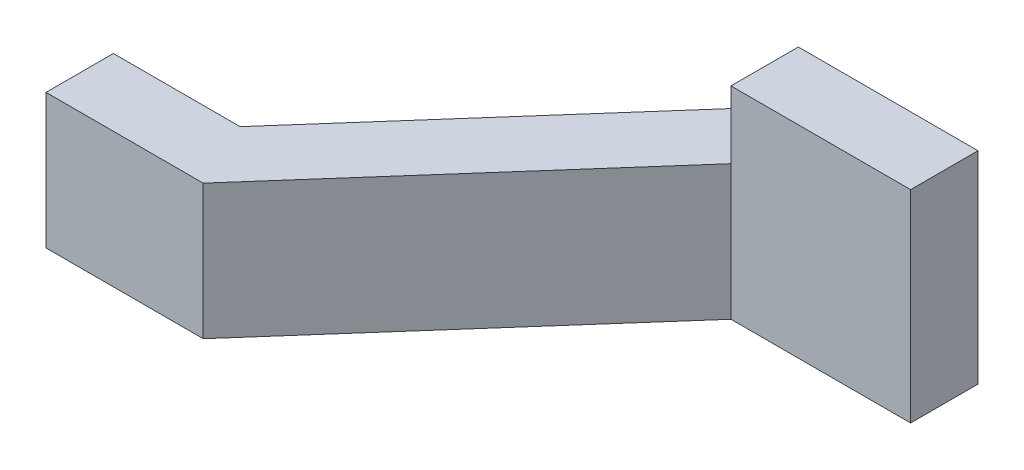
ISO-10303-21;
HEADER;
FILE_DESCRIPTION(('STEP AP214'),'2;1');
FILE_NAME('part.step','',(''),(''),'','','');
FILE_SCHEMA(('AUTOMOTIVE_DESIGN { 1 0 10303 214 1 1 1 1 }'));
ENDSEC;
DATA;
#1=APPLICATION_CONTEXT('core data for automotive mechanical design processes');
#2=APPLICATION_PROTOCOL_DEFINITION('international standard','automotive_design',2000,#1);
#3=PRODUCT_CONTEXT('',#1,'mechanical');
#4=PRODUCT('Part','Part','',(#3));
#5=PRODUCT_RELATED_PRODUCT_CATEGORY('part','',(#4));
#6=PRODUCT_DEFINITION_FORMATION('','',#4);
#7=PRODUCT_DEFINITION_CONTEXT('part definition',#1,'design');
#8=PRODUCT_DEFINITION('design','',#6,#7);
#9=PRODUCT_DEFINITION_SHAPE('','',#8);
#10=(LENGTH_UNIT() NAMED_UNIT(*) SI_UNIT(.MILLI.,.METRE.));
#11=(NAMED_UNIT(*) PLANE_ANGLE_UNIT() SI_UNIT($,.RADIAN.));
#12=(NAMED_UNIT(*) SI_UNIT($,.STERADIAN.) SOLID_ANGLE_UNIT());
#13=UNCERTAINTY_MEASURE_WITH_UNIT(LENGTH_MEASURE(1.E-05),#10,'distance_accuracy_value','');
#14=(GEOMETRIC_REPRESENTATION_CONTEXT(3) GLOBAL_UNCERTAINTY_ASSIGNED_CONTEXT((#13)) GLOBAL_UNIT_ASSIGNED_CONTEXT((#10,
#11,#12)) REPRESENTATION_CONTEXT('',''));
#15=CARTESIAN_POINT('',(0.,0.,0.));
#16=DIRECTION('',(0.,0.,1.));
#17=DIRECTION('',(1.,0.,0.));
#18=AXIS2_PLACEMENT_3D('',#15,#16,#17);
#19=CARTESIAN_POINT('',(0.,0.762,0.));
#20=DIRECTION('',(1.,0.,0.));
#21=DIRECTION('',(0.,0.,-1.));
#22=AXIS2_PLACEMENT_3D('',#19,#20,#21);
#23=PLANE('',#22);
#24=DIRECTION('',(0.,0.,-1.));
#25=VECTOR('',#24,1.);
#26=CARTESIAN_POINT('',(0.,-0.381,0.));
#27=LINE('',#26,#25);
#28=CARTESIAN_POINT('',(0.,-0.381,0.));
#29=VERTEX_POINT('',#28);
#30=CARTESIAN_POINT('',(0.,-0.381,-0.381));
#31=VERTEX_POINT('',#30);
#32=EDGE_CURVE('E191',#29,#31,#27,.T.);
#33=ORIENTED_EDGE('',*,*,#32,.F.);
#34=DIRECTION('',(0.,-1.,0.));
#35=VECTOR('',#34,1.);
#36=CARTESIAN_POINT('',(0.,0.762,0.));
#37=LINE('',#36,#35);
#38=CARTESIAN_POINT('',(0.,0.381,0.));
#39=VERTEX_POINT('',#38);
#40=EDGE_CURVE('E148',#39,#29,#37,.T.);
#41=ORIENTED_EDGE('',*,*,#40,.F.);
#42=DIRECTION('',(0.,0.,-1.));
#43=VECTOR('',#42,1.);
#44=CARTESIAN_POINT('',(0.,0.381,0.));
#45=LINE('',#44,#43);
#46=CARTESIAN_POINT('',(0.,0.381,-0.381));
#47=VERTEX_POINT('',#46);
#48=EDGE_CURVE('E176',#39,#47,#45,.T.);
#49=ORIENTED_EDGE('',*,*,#48,.T.);
#50=DIRECTION('',(0.,-1.,0.));
#51=VECTOR('',#50,1.);
#52=CARTESIAN_POINT('',(0.,0.762,-0.381));
#53=LINE('',#52,#51);
#54=EDGE_CURVE('E160',#47,#31,#53,.T.);
#55=ORIENTED_EDGE('',*,*,#54,.T.);
#56=EDGE_LOOP('',(#33,#41,#49,#55));
#57=FACE_BOUND('',#56,.T.);
#58=ADVANCED_FACE('F38',(#57),#23,.F.);
#59=CARTESIAN_POINT('',(0.,0.762,0.));
#60=DIRECTION('',(0.,0.,-1.));
#61=DIRECTION('',(-1.,0.,0.));
#62=AXIS2_PLACEMENT_3D('',#59,#60,#61);
#63=PLANE('',#62);
#64=DIRECTION('',(-1.,0.,0.));
#65=VECTOR('',#64,1.);
#66=CARTESIAN_POINT('',(0.,-0.381,0.));
#67=LINE('',#66,#65);
#68=CARTESIAN_POINT('',(0.888999999999999,-0.381,0.));
#69=VERTEX_POINT('',#68);
#70=EDGE_CURVE('E121',#69,#29,#67,.T.);
#71=ORIENTED_EDGE('',*,*,#70,.F.);
#72=DIRECTION('',(0.,-1.,0.));
#73=VECTOR('',#72,1.);
#74=CARTESIAN_POINT('',(0.889,0.762,0.));
#75=LINE('',#74,#73);
#76=CARTESIAN_POINT('',(0.889,0.381,0.));
#77=VERTEX_POINT('',#76);
#78=EDGE_CURVE('E145',#77,#69,#75,.T.);
#79=ORIENTED_EDGE('',*,*,#78,.F.);
#80=DIRECTION('',(-1.,0.,0.));
#81=VECTOR('',#80,1.);
#82=CARTESIAN_POINT('',(0.,0.381,0.));
#83=LINE('',#82,#81);
#84=EDGE_CURVE('E179',#77,#39,#83,.T.);
#85=ORIENTED_EDGE('',*,*,#84,.T.);
#86=ORIENTED_EDGE('',*,*,#40,.T.);
#87=EDGE_LOOP('',(#71,#79,#85,#86));
#88=FACE_BOUND('',#87,.T.);
#89=ADVANCED_FACE('F204',(#88),#63,.F.);
#90=CARTESIAN_POINT('',(0.889,0.762,0.));
#91=DIRECTION('',(-0.750713516922755,0.,-0.660627894892025));
#92=DIRECTION('',(-0.660627894892025,0.,0.750713516922755));
#93=AXIS2_PLACEMENT_3D('',#90,#91,#92);
#94=PLANE('',#93);
#95=DIRECTION('',(-0.660627894892025,0.,0.750713516922755));
#96=VECTOR('',#95,1.);
#97=CARTESIAN_POINT('',(0.889,-0.381,0.));
#98=LINE('',#97,#96);
#99=CARTESIAN_POINT('',(2.286,-0.381,-1.5875));
#100=VERTEX_POINT('',#99);
#101=EDGE_CURVE('E186',#100,#69,#98,.T.);
#102=ORIENTED_EDGE('',*,*,#101,.F.);
#103=DIRECTION('',(0.,-1.,0.));
#104=VECTOR('',#103,1.);
#105=CARTESIAN_POINT('',(2.286,0.762,-1.5875));
#106=LINE('',#105,#104);
#107=CARTESIAN_POINT('',(2.286,0.381,-1.5875));
#108=VERTEX_POINT('',#107);
#109=EDGE_CURVE('E136',#108,#100,#106,.T.);
#110=ORIENTED_EDGE('',*,*,#109,.F.);
#111=DIRECTION('',(-0.660627894892025,0.,0.750713516922755));
#112=VECTOR('',#111,1.);
#113=CARTESIAN_POINT('',(0.889,0.381,0.));
#114=LINE('',#113,#112);
#115=EDGE_CURVE('E172',#108,#77,#114,.T.);
#116=ORIENTED_EDGE('',*,*,#115,.T.);
#117=ORIENTED_EDGE('',*,*,#78,.T.);
#118=EDGE_LOOP('',(#102,#110,#116,#117));
#119=FACE_BOUND('',#118,.T.);
#120=ADVANCED_FACE('F201',(#119),#94,.F.);
#121=CARTESIAN_POINT('',(3.302,0.762,-1.9685));
#122=DIRECTION('',(0.,0.,1.));
#123=DIRECTION('',(1.,0.,0.));
#124=AXIS2_PLACEMENT_3D('',#121,#122,#123);
#125=PLANE('',#124);
#126=DIRECTION('',(0.,-1.,0.));
#127=VECTOR('',#126,1.);
#128=CARTESIAN_POINT('',(3.302,0.762,-1.9685));
#129=LINE('',#128,#127);
#130=CARTESIAN_POINT('',(3.302,0.762,-1.9685));
#131=VERTEX_POINT('',#130);
#132=CARTESIAN_POINT('',(3.302,-0.381,-1.9685));
#133=VERTEX_POINT('',#132);
#134=EDGE_CURVE('E127',#131,#133,#129,.T.);
#135=ORIENTED_EDGE('',*,*,#134,.T.);
#136=DIRECTION('',(-1.,0.,0.));
#137=VECTOR('',#136,1.);
#138=CARTESIAN_POINT('',(0.,-0.381,-1.9685));
#139=LINE('',#138,#137);
#140=CARTESIAN_POINT('',(2.11376282945303,-0.381,-1.9685));
#141=VERTEX_POINT('',#140);
#142=EDGE_CURVE('E110',#133,#141,#139,.T.);
#143=ORIENTED_EDGE('',*,*,#142,.T.);
#144=DIRECTION('',(0.,-1.,0.));
#145=VECTOR('',#144,1.);
#146=CARTESIAN_POINT('',(2.11376282945303,0.762,-1.9685));
#147=LINE('',#146,#145);
#148=CARTESIAN_POINT('',(2.11376282945303,0.381,-1.9685));
#149=VERTEX_POINT('',#148);
#150=EDGE_CURVE('E134',#149,#141,#147,.T.);
#151=ORIENTED_EDGE('',*,*,#150,.F.);
#152=DIRECTION('',(-1.,0.,0.));
#153=VECTOR('',#152,1.);
#154=CARTESIAN_POINT('',(0.,0.381,-1.9685));
#155=LINE('',#154,#153);
#156=CARTESIAN_POINT('',(2.286,0.381,-1.9685));
#157=VERTEX_POINT('',#156);
#158=EDGE_CURVE('E181',#157,#149,#155,.T.);
#159=ORIENTED_EDGE('',*,*,#158,.F.);
#160=DIRECTION('',(0.,-1.,0.));
#161=VECTOR('',#160,1.);
#162=CARTESIAN_POINT('',(2.286,0.762,-1.9685));
#163=LINE('',#162,#161);
#164=CARTESIAN_POINT('',(2.286,0.762,-1.9685));
#165=VERTEX_POINT('',#164);
#166=EDGE_CURVE('E183',#165,#157,#163,.T.);
#167=ORIENTED_EDGE('',*,*,#166,.F.);
#168=DIRECTION('',(-1.,0.,0.));
#169=VECTOR('',#168,1.);
#170=CARTESIAN_POINT('',(3.302,0.762,-1.9685));
#171=LINE('',#170,#169);
#172=EDGE_CURVE('E133',#131,#165,#171,.T.);
#173=ORIENTED_EDGE('',*,*,#172,.F.);
#174=EDGE_LOOP('',(#135,#143,#151,#159,#167,#173));
#175=FACE_BOUND('',#174,.T.);
#176=ADVANCED_FACE('F131',(#175),#125,.F.);
#177=CARTESIAN_POINT('',(0.716762829453032,0.762,-0.381));
#178=DIRECTION('',(0.750713516922755,0.,0.660627894892025));
#179=DIRECTION('',(0.660627894892025,0.,-0.750713516922755));
#180=AXIS2_PLACEMENT_3D('',#177,#178,#179);
#181=PLANE('',#180);
#182=DIRECTION('',(0.660627894892025,0.,-0.750713516922755));
#183=VECTOR('',#182,1.);
#184=CARTESIAN_POINT('',(0.716762829453032,-0.381,-0.381));
#185=LINE('',#184,#183);
#186=CARTESIAN_POINT('',(0.716762829453032,-0.381,-0.381));
#187=VERTEX_POINT('',#186);
#188=EDGE_CURVE('E116',#187,#141,#185,.T.);
#189=ORIENTED_EDGE('',*,*,#188,.F.);
#190=DIRECTION('',(0.,-1.,0.));
#191=VECTOR('',#190,1.);
#192=CARTESIAN_POINT('',(0.716762829453032,0.762,-0.381));
#193=LINE('',#192,#191);
#194=CARTESIAN_POINT('',(0.716762829453032,0.381,-0.381));
#195=VERTEX_POINT('',#194);
#196=EDGE_CURVE('E138',#195,#187,#193,.T.);
#197=ORIENTED_EDGE('',*,*,#196,.F.);
#198=DIRECTION('',(0.660627894892025,0.,-0.750713516922755));
#199=VECTOR('',#198,1.);
#200=CARTESIAN_POINT('',(0.716762829453032,0.381,-0.381));
#201=LINE('',#200,#199);
#202=EDGE_CURVE('E166',#195,#149,#201,.T.);
#203=ORIENTED_EDGE('',*,*,#202,.T.);
#204=ORIENTED_EDGE('',*,*,#150,.T.);
#205=EDGE_LOOP('',(#189,#197,#203,#204));
#206=FACE_BOUND('',#205,.T.);
#207=ADVANCED_FACE('F165',(#206),#181,.F.);
#208=CARTESIAN_POINT('',(0.,0.762,-0.381));
#209=DIRECTION('',(0.,0.,1.));
#210=DIRECTION('',(1.,0.,0.));
#211=AXIS2_PLACEMENT_3D('',#208,#209,#210);
#212=PLANE('',#211);
#213=DIRECTION('',(1.,0.,0.));
#214=VECTOR('',#213,1.);
#215=CARTESIAN_POINT('',(0.,-0.381,-0.381));
#216=LINE('',#215,#214);
#217=EDGE_CURVE('E11',#31,#187,#216,.T.);
#218=ORIENTED_EDGE('',*,*,#217,.F.);
#219=ORIENTED_EDGE('',*,*,#54,.F.);
#220=DIRECTION('',(1.,0.,0.));
#221=VECTOR('',#220,1.);
#222=CARTESIAN_POINT('',(0.,0.381,-0.381));
#223=LINE('',#222,#221);
#224=EDGE_CURVE('E45',#47,#195,#223,.T.);
#225=ORIENTED_EDGE('',*,*,#224,.T.);
#226=ORIENTED_EDGE('',*,*,#196,.T.);
#227=EDGE_LOOP('',(#218,#219,#225,#226));
#228=FACE_BOUND('',#227,.T.);
#229=ADVANCED_FACE('F158',(#228),#212,.F.);
#230=CARTESIAN_POINT('',(2.286,0.762,-1.5875));
#231=DIRECTION('',(0.,0.,-1.));
#232=DIRECTION('',(-1.,0.,0.));
#233=AXIS2_PLACEMENT_3D('',#230,#231,#232);
#234=PLANE('',#233);
#235=ORIENTED_EDGE('',*,*,#109,.T.);
#236=DIRECTION('',(1.,0.,0.));
#237=VECTOR('',#236,1.);
#238=CARTESIAN_POINT('',(2.286,-0.381,-1.5875));
#239=LINE('',#238,#237);
#240=CARTESIAN_POINT('',(3.302,-0.381,-1.5875));
#241=VERTEX_POINT('',#240);
#242=EDGE_CURVE('E122',#100,#241,#239,.T.);
#243=ORIENTED_EDGE('',*,*,#242,.T.);
#244=DIRECTION('',(0.,-1.,0.));
#245=VECTOR('',#244,1.);
#246=CARTESIAN_POINT('',(3.302,0.762,-1.5875));
#247=LINE('',#246,#245);
#248=CARTESIAN_POINT('',(3.302,0.762,-1.5875));
#249=VERTEX_POINT('',#248);
#250=EDGE_CURVE('E129',#249,#241,#247,.T.);
#251=ORIENTED_EDGE('',*,*,#250,.F.);
#252=DIRECTION('',(1.,0.,0.));
#253=VECTOR('',#252,1.);
#254=CARTESIAN_POINT('',(2.286,0.762,-1.5875));
#255=LINE('',#254,#253);
#256=CARTESIAN_POINT('',(2.286,0.762,-1.5875));
#257=VERTEX_POINT('',#256);
#258=EDGE_CURVE('E57',#257,#249,#255,.T.);
#259=ORIENTED_EDGE('',*,*,#258,.F.);
#260=EDGE_CURVE('E142',#257,#108,#106,.T.);
#261=ORIENTED_EDGE('',*,*,#260,.T.);
#262=EDGE_LOOP('',(#235,#243,#251,#259,#261));
#263=FACE_BOUND('',#262,.T.);
#264=ADVANCED_FACE('F196',(#263),#234,.F.);
#265=CARTESIAN_POINT('',(3.302,0.762,-1.5875));
#266=DIRECTION('',(-1.,0.,0.));
#267=DIRECTION('',(0.,0.,1.));
#268=AXIS2_PLACEMENT_3D('',#265,#266,#267);
#269=PLANE('',#268);
#270=ORIENTED_EDGE('',*,*,#250,.T.);
#271=DIRECTION('',(0.,0.,-1.));
#272=VECTOR('',#271,1.);
#273=CARTESIAN_POINT('',(3.302,-0.381,0.));
#274=LINE('',#273,#272);
#275=EDGE_CURVE('E113',#241,#133,#274,.T.);
#276=ORIENTED_EDGE('',*,*,#275,.T.);
#277=ORIENTED_EDGE('',*,*,#134,.F.);
#278=DIRECTION('',(0.,0.,-1.));
#279=VECTOR('',#278,1.);
#280=CARTESIAN_POINT('',(3.302,0.762,-1.5875));
#281=LINE('',#280,#279);
#282=EDGE_CURVE('E52',#249,#131,#281,.T.);
#283=ORIENTED_EDGE('',*,*,#282,.F.);
#284=EDGE_LOOP('',(#270,#276,#277,#283));
#285=FACE_BOUND('',#284,.T.);
#286=ADVANCED_FACE('F126',(#285),#269,.F.);
#287=CARTESIAN_POINT('',(0.,0.762,0.));
#288=DIRECTION('',(0.,-1.,0.));
#289=DIRECTION('',(0.,0.,-1.));
#290=AXIS2_PLACEMENT_3D('',#287,#288,#289);
#291=PLANE('',#290);
#292=ORIENTED_EDGE('',*,*,#172,.T.);
#293=DIRECTION('',(0.,0.,1.));
#294=VECTOR('',#293,1.);
#295=CARTESIAN_POINT('',(2.286,0.762,0.));
#296=LINE('',#295,#294);
#297=EDGE_CURVE('E151',#165,#257,#296,.T.);
#298=ORIENTED_EDGE('',*,*,#297,.T.);
#299=ORIENTED_EDGE('',*,*,#258,.T.);
#300=ORIENTED_EDGE('',*,*,#282,.T.);
#301=EDGE_LOOP('',(#292,#298,#299,#300));
#302=FACE_BOUND('',#301,.T.);
#303=ADVANCED_FACE('F213',(#302),#291,.F.);
#304=CARTESIAN_POINT('',(0.,0.381,0.));
#305=DIRECTION('',(0.,-1.,0.));
#306=DIRECTION('',(1.,0.,0.));
#307=AXIS2_PLACEMENT_3D('',#304,#305,#306);
#308=PLANE('',#307);
#309=DIRECTION('',(0.,0.,-1.));
#310=VECTOR('',#309,1.);
#311=CARTESIAN_POINT('',(2.286,0.381,0.));
#312=LINE('',#311,#310);
#313=EDGE_CURVE('E177',#108,#157,#312,.T.);
#314=ORIENTED_EDGE('',*,*,#313,.T.);
#315=ORIENTED_EDGE('',*,*,#158,.T.);
#316=ORIENTED_EDGE('',*,*,#202,.F.);
#317=ORIENTED_EDGE('',*,*,#224,.F.);
#318=ORIENTED_EDGE('',*,*,#48,.F.);
#319=ORIENTED_EDGE('',*,*,#84,.F.);
#320=ORIENTED_EDGE('',*,*,#115,.F.);
#321=EDGE_LOOP('',(#314,#315,#316,#317,#318,#319,#320));
#322=FACE_BOUND('',#321,.T.);
#323=ADVANCED_FACE('F208',(#322),#308,.F.);
#324=CARTESIAN_POINT('',(2.286,0.762,0.));
#325=DIRECTION('',(1.,0.,0.));
#326=DIRECTION('',(0.,0.,-1.));
#327=AXIS2_PLACEMENT_3D('',#324,#325,#326);
#328=PLANE('',#327);
#329=ORIENTED_EDGE('',*,*,#297,.F.);
#330=ORIENTED_EDGE('',*,*,#166,.T.);
#331=ORIENTED_EDGE('',*,*,#313,.F.);
#332=ORIENTED_EDGE('',*,*,#260,.F.);
#333=EDGE_LOOP('',(#329,#330,#331,#332));
#334=FACE_BOUND('',#333,.T.);
#335=ADVANCED_FACE('F211',(#334),#328,.F.);
#336=CARTESIAN_POINT('',(0.,-0.381,0.));
#337=DIRECTION('',(0.,-1.,0.));
#338=DIRECTION('',(1.,0.,0.));
#339=AXIS2_PLACEMENT_3D('',#336,#337,#338);
#340=PLANE('',#339);
#341=ORIENTED_EDGE('',*,*,#101,.T.);
#342=ORIENTED_EDGE('',*,*,#70,.T.);
#343=ORIENTED_EDGE('',*,*,#32,.T.);
#344=ORIENTED_EDGE('',*,*,#217,.T.);
#345=ORIENTED_EDGE('',*,*,#188,.T.);
#346=ORIENTED_EDGE('',*,*,#142,.F.);
#347=ORIENTED_EDGE('',*,*,#275,.F.);
#348=ORIENTED_EDGE('',*,*,#242,.F.);
#349=EDGE_LOOP('',(#341,#342,#343,#344,#345,#346,#347,#348));
#350=FACE_BOUND('',#349,.T.);
#351=ADVANCED_FACE('F112',(#350),#340,.T.);
#352=CLOSED_SHELL('',(#58,#89,#120,#176,#207,#229,#264,#286,#303,#323,#335,#351));
#353=MANIFOLD_SOLID_BREP('B2',#352);
#354=ADVANCED_BREP_SHAPE_REPRESENTATION('',(#18,#353),#14);
#355=SHAPE_DEFINITION_REPRESENTATION(#9,#354);
ENDSEC;
END-ISO-10303-21;
